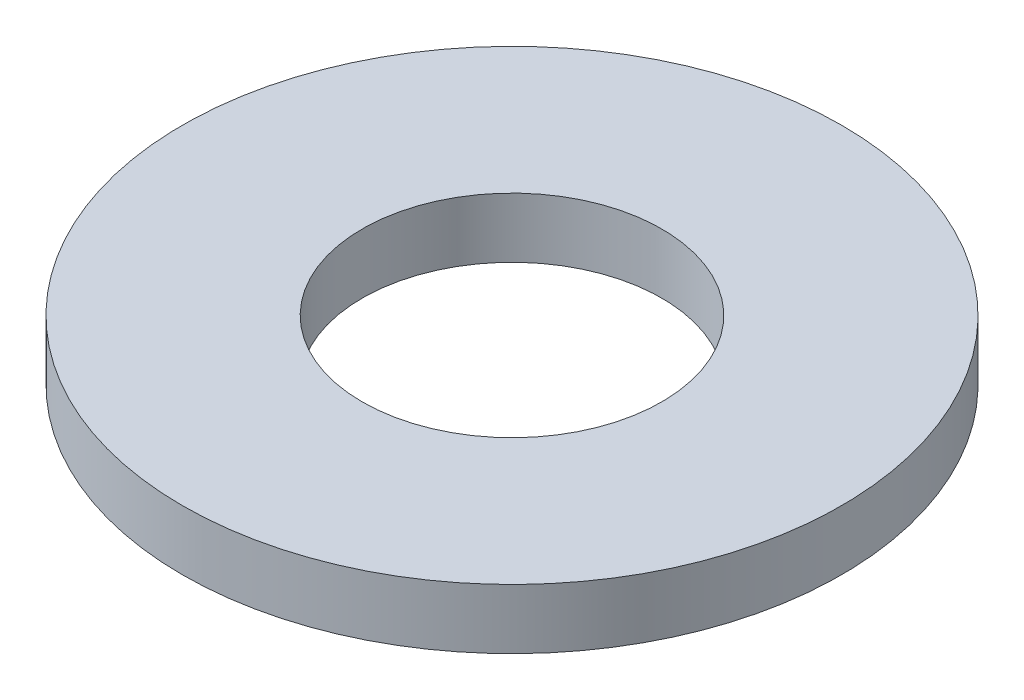
ISO-10303-21;
HEADER;
FILE_DESCRIPTION(('STEP AP214'),'2;1');
FILE_NAME('part.step','',(''),(''),'','','');
FILE_SCHEMA(('AUTOMOTIVE_DESIGN { 1 0 10303 214 1 1 1 1 }'));
ENDSEC;
DATA;
#1=APPLICATION_CONTEXT('core data for automotive mechanical design processes');
#2=APPLICATION_PROTOCOL_DEFINITION('international standard','automotive_design',2000,#1);
#3=PRODUCT_CONTEXT('',#1,'mechanical');
#4=PRODUCT('Part','Part','',(#3));
#5=PRODUCT_RELATED_PRODUCT_CATEGORY('part','',(#4));
#6=PRODUCT_DEFINITION_FORMATION('','',#4);
#7=PRODUCT_DEFINITION_CONTEXT('part definition',#1,'design');
#8=PRODUCT_DEFINITION('design','',#6,#7);
#9=PRODUCT_DEFINITION_SHAPE('','',#8);
#10=(LENGTH_UNIT() NAMED_UNIT(*) SI_UNIT(.MILLI.,.METRE.));
#11=(NAMED_UNIT(*) PLANE_ANGLE_UNIT() SI_UNIT($,.RADIAN.));
#12=(NAMED_UNIT(*) SI_UNIT($,.STERADIAN.) SOLID_ANGLE_UNIT());
#13=UNCERTAINTY_MEASURE_WITH_UNIT(LENGTH_MEASURE(1.E-05),#10,'distance_accuracy_value','');
#14=(GEOMETRIC_REPRESENTATION_CONTEXT(3) GLOBAL_UNCERTAINTY_ASSIGNED_CONTEXT((#13)) GLOBAL_UNIT_ASSIGNED_CONTEXT((#10,
#11,#12)) REPRESENTATION_CONTEXT('',''));
#15=CARTESIAN_POINT('',(0.,0.,0.));
#16=DIRECTION('',(0.,0.,1.));
#17=DIRECTION('',(1.,0.,0.));
#18=AXIS2_PLACEMENT_3D('',#15,#16,#17);
#19=CARTESIAN_POINT('',(0.,1.,0.));
#20=DIRECTION('',(0.,1.,0.));
#21=DIRECTION('',(0.,0.,1.));
#22=AXIS2_PLACEMENT_3D('',#19,#20,#21);
#23=PLANE('',#22);
#24=CARTESIAN_POINT('',(0.,1.,0.));
#25=DIRECTION('',(0.,1.,0.));
#26=DIRECTION('',(0.,0.,1.));
#27=AXIS2_PLACEMENT_3D('',#24,#25,#26);
#28=CIRCLE('',#27,5.5);
#29=CARTESIAN_POINT('',(0.,1.,5.5));
#30=VERTEX_POINT('',#29);
#31=EDGE_CURVE('E10',#30,#30,#28,.T.);
#32=ORIENTED_EDGE('',*,*,#31,.T.);
#33=EDGE_LOOP('',(#32));
#34=FACE_BOUND('',#33,.T.);
#35=CARTESIAN_POINT('',(0.,1.,0.));
#36=DIRECTION('',(0.,1.,0.));
#37=DIRECTION('',(0.,0.,1.));
#38=AXIS2_PLACEMENT_3D('',#35,#36,#37);
#39=CIRCLE('',#38,2.5);
#40=CARTESIAN_POINT('',(0.,1.,2.5));
#41=VERTEX_POINT('',#40);
#42=EDGE_CURVE('E48',#41,#41,#39,.T.);
#43=ORIENTED_EDGE('',*,*,#42,.F.);
#44=EDGE_LOOP('',(#43));
#45=FACE_BOUND('',#44,.T.);
#46=ADVANCED_FACE('F37',(#34,#45),#23,.T.);
#47=CARTESIAN_POINT('',(0.,0.,0.));
#48=DIRECTION('',(0.,1.,0.));
#49=DIRECTION('',(0.,0.,1.));
#50=AXIS2_PLACEMENT_3D('',#47,#48,#49);
#51=PLANE('',#50);
#52=CARTESIAN_POINT('',(0.,0.,0.));
#53=DIRECTION('',(0.,1.,0.));
#54=DIRECTION('',(0.,0.,1.));
#55=AXIS2_PLACEMENT_3D('',#52,#53,#54);
#56=CIRCLE('',#55,5.5);
#57=CARTESIAN_POINT('',(0.,0.,5.5));
#58=VERTEX_POINT('',#57);
#59=EDGE_CURVE('E41',#58,#58,#56,.T.);
#60=ORIENTED_EDGE('',*,*,#59,.F.);
#61=EDGE_LOOP('',(#60));
#62=FACE_BOUND('',#61,.T.);
#63=CARTESIAN_POINT('',(0.,0.,0.));
#64=DIRECTION('',(0.,1.,0.));
#65=DIRECTION('',(0.,0.,1.));
#66=AXIS2_PLACEMENT_3D('',#63,#64,#65);
#67=CIRCLE('',#66,2.5);
#68=CARTESIAN_POINT('',(0.,0.,2.5));
#69=VERTEX_POINT('',#68);
#70=EDGE_CURVE('E50',#69,#69,#67,.T.);
#71=ORIENTED_EDGE('',*,*,#70,.T.);
#72=EDGE_LOOP('',(#71));
#73=FACE_BOUND('',#72,.T.);
#74=ADVANCED_FACE('F60',(#62,#73),#51,.F.);
#75=CARTESIAN_POINT('',(0.,1.,0.));
#76=DIRECTION('',(0.,-1.,0.));
#77=DIRECTION('',(0.,0.,-1.));
#78=AXIS2_PLACEMENT_3D('',#75,#76,#77);
#79=CYLINDRICAL_SURFACE('',#78,5.5);
#80=ORIENTED_EDGE('',*,*,#31,.F.);
#81=EDGE_LOOP('',(#80));
#82=FACE_BOUND('',#81,.T.);
#83=ORIENTED_EDGE('',*,*,#59,.T.);
#84=EDGE_LOOP('',(#83));
#85=FACE_BOUND('',#84,.T.);
#86=ADVANCED_FACE('F39',(#82,#85),#79,.T.);
#87=CARTESIAN_POINT('',(0.,1.,0.));
#88=DIRECTION('',(0.,-1.,0.));
#89=DIRECTION('',(0.,0.,-1.));
#90=AXIS2_PLACEMENT_3D('',#87,#88,#89);
#91=CYLINDRICAL_SURFACE('',#90,2.5);
#92=ORIENTED_EDGE('',*,*,#42,.T.);
#93=EDGE_LOOP('',(#92));
#94=FACE_BOUND('',#93,.T.);
#95=ORIENTED_EDGE('',*,*,#70,.F.);
#96=EDGE_LOOP('',(#95));
#97=FACE_BOUND('',#96,.T.);
#98=ADVANCED_FACE('F56',(#94,#97),#91,.F.);
#99=CLOSED_SHELL('',(#46,#74,#86,#98));
#100=MANIFOLD_SOLID_BREP('B2',#99);
#101=ADVANCED_BREP_SHAPE_REPRESENTATION('',(#18,#100),#14);
#102=SHAPE_DEFINITION_REPRESENTATION(#9,#101);
ENDSEC;
END-ISO-10303-21;
